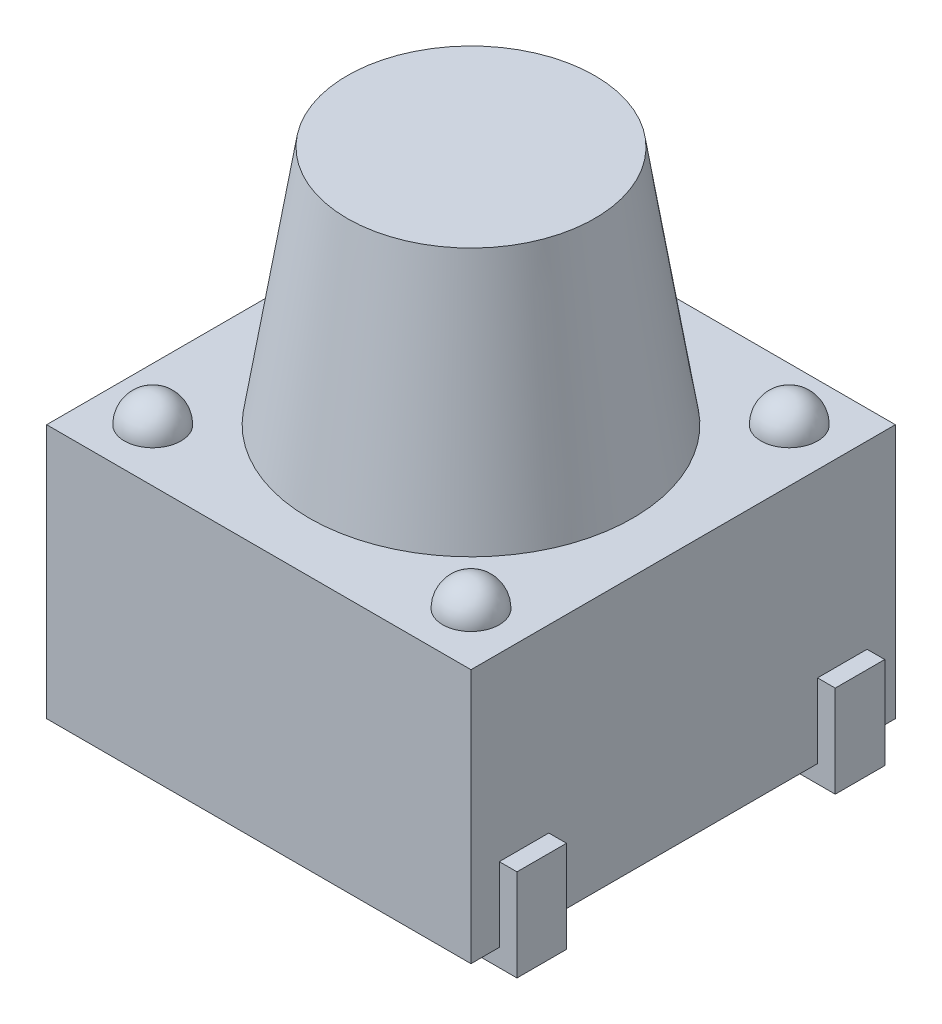
ISO-10303-21;
HEADER;
FILE_DESCRIPTION(('STEP AP214'),'2;1');
FILE_NAME('part.step','',(''),(''),'','','');
FILE_SCHEMA(('AUTOMOTIVE_DESIGN { 1 0 10303 214 1 1 1 1 }'));
ENDSEC;
DATA;
#1=APPLICATION_CONTEXT('core data for automotive mechanical design processes');
#2=APPLICATION_PROTOCOL_DEFINITION('international standard','automotive_design',2000,#1);
#3=PRODUCT_CONTEXT('',#1,'mechanical');
#4=PRODUCT('Part','Part','',(#3));
#5=PRODUCT_RELATED_PRODUCT_CATEGORY('part','',(#4));
#6=PRODUCT_DEFINITION_FORMATION('','',#4);
#7=PRODUCT_DEFINITION_CONTEXT('part definition',#1,'design');
#8=PRODUCT_DEFINITION('design','',#6,#7);
#9=PRODUCT_DEFINITION_SHAPE('','',#8);
#10=(LENGTH_UNIT() NAMED_UNIT(*) SI_UNIT(.MILLI.,.METRE.));
#11=(NAMED_UNIT(*) PLANE_ANGLE_UNIT() SI_UNIT($,.RADIAN.));
#12=(NAMED_UNIT(*) SI_UNIT($,.STERADIAN.) SOLID_ANGLE_UNIT());
#13=UNCERTAINTY_MEASURE_WITH_UNIT(LENGTH_MEASURE(1.E-05),#10,'distance_accuracy_value','');
#14=(GEOMETRIC_REPRESENTATION_CONTEXT(3) GLOBAL_UNCERTAINTY_ASSIGNED_CONTEXT((#13)) GLOBAL_UNIT_ASSIGNED_CONTEXT((#10,
#11,#12)) REPRESENTATION_CONTEXT('',''));
#15=CARTESIAN_POINT('',(0.,0.,0.));
#16=DIRECTION('',(0.,0.,1.));
#17=DIRECTION('',(1.,0.,0.));
#18=AXIS2_PLACEMENT_3D('',#15,#16,#17);
#19=CARTESIAN_POINT('',(-3.,3.6,3.));
#20=DIRECTION('',(0.,1.,0.));
#21=DIRECTION('',(0.,0.,1.));
#22=AXIS2_PLACEMENT_3D('',#19,#20,#21);
#23=PLANE('',#22);
#24=CARTESIAN_POINT('',(0.,3.6,0.));
#25=DIRECTION('',(0.,1.,0.));
#26=DIRECTION('',(0.,0.,1.));
#27=AXIS2_PLACEMENT_3D('',#24,#25,#26);
#28=CIRCLE('',#27,2.28850709710341);
#29=CARTESIAN_POINT('',(0.,3.6,2.28850709710341));
#30=VERTEX_POINT('',#29);
#31=EDGE_CURVE('E11',#30,#30,#28,.T.);
#32=ORIENTED_EDGE('',*,*,#31,.F.);
#33=EDGE_LOOP('',(#32));
#34=FACE_BOUND('',#33,.T.);
#35=CARTESIAN_POINT('',(2.25,3.6,-2.25));
#36=DIRECTION('',(0.,1.,0.));
#37=DIRECTION('',(0.,0.,-1.));
#38=AXIS2_PLACEMENT_3D('',#35,#36,#37);
#39=CIRCLE('',#38,0.4);
#40=CARTESIAN_POINT('',(2.25,3.6,-2.65));
#41=VERTEX_POINT('',#40);
#42=EDGE_CURVE('E409',#41,#41,#39,.T.);
#43=ORIENTED_EDGE('',*,*,#42,.F.);
#44=EDGE_LOOP('',(#43));
#45=FACE_BOUND('',#44,.T.);
#46=CARTESIAN_POINT('',(-2.25,3.6,2.25));
#47=DIRECTION('',(0.,1.,0.));
#48=DIRECTION('',(0.,0.,1.));
#49=AXIS2_PLACEMENT_3D('',#46,#47,#48);
#50=CIRCLE('',#49,0.4);
#51=CARTESIAN_POINT('',(-2.25,3.6,2.65));
#52=VERTEX_POINT('',#51);
#53=EDGE_CURVE('E415',#52,#52,#50,.T.);
#54=ORIENTED_EDGE('',*,*,#53,.F.);
#55=EDGE_LOOP('',(#54));
#56=FACE_BOUND('',#55,.T.);
#57=DIRECTION('',(0.,0.,1.));
#58=VECTOR('',#57,1.);
#59=CARTESIAN_POINT('',(-3.,3.6,-3.));
#60=LINE('',#59,#58);
#61=CARTESIAN_POINT('',(-3.,3.6,-3.));
#62=VERTEX_POINT('',#61);
#63=CARTESIAN_POINT('',(-3.,3.6,3.));
#64=VERTEX_POINT('',#63);
#65=EDGE_CURVE('E419',#62,#64,#60,.T.);
#66=ORIENTED_EDGE('',*,*,#65,.T.);
#67=DIRECTION('',(1.,0.,0.));
#68=VECTOR('',#67,1.);
#69=CARTESIAN_POINT('',(-3.,3.6,3.));
#70=LINE('',#69,#68);
#71=CARTESIAN_POINT('',(3.,3.6,3.));
#72=VERTEX_POINT('',#71);
#73=EDGE_CURVE('E422',#64,#72,#70,.T.);
#74=ORIENTED_EDGE('',*,*,#73,.T.);
#75=DIRECTION('',(0.,0.,-1.));
#76=VECTOR('',#75,1.);
#77=CARTESIAN_POINT('',(3.,3.6,-3.));
#78=LINE('',#77,#76);
#79=CARTESIAN_POINT('',(3.,3.6,-3.));
#80=VERTEX_POINT('',#79);
#81=EDGE_CURVE('E425',#72,#80,#78,.T.);
#82=ORIENTED_EDGE('',*,*,#81,.T.);
#83=DIRECTION('',(-1.,0.,0.));
#84=VECTOR('',#83,1.);
#85=CARTESIAN_POINT('',(-3.,3.6,-3.));
#86=LINE('',#85,#84);
#87=EDGE_CURVE('E427',#80,#62,#86,.T.);
#88=ORIENTED_EDGE('',*,*,#87,.T.);
#89=EDGE_LOOP('',(#66,#74,#82,#88));
#90=FACE_BOUND('',#89,.T.);
#91=CARTESIAN_POINT('',(-2.25,3.6,-2.25));
#92=DIRECTION('',(0.,-1.,0.));
#93=DIRECTION('',(0.,0.,-1.));
#94=AXIS2_PLACEMENT_3D('',#91,#92,#93);
#95=CIRCLE('',#94,0.4);
#96=CARTESIAN_POINT('',(-2.25,3.6,-2.65));
#97=VERTEX_POINT('',#96);
#98=EDGE_CURVE('E412',#97,#97,#95,.T.);
#99=ORIENTED_EDGE('',*,*,#98,.T.);
#100=EDGE_LOOP('',(#99));
#101=FACE_BOUND('',#100,.T.);
#102=CARTESIAN_POINT('',(2.25,3.6,2.25));
#103=DIRECTION('',(0.,-1.,0.));
#104=DIRECTION('',(0.,0.,1.));
#105=AXIS2_PLACEMENT_3D('',#102,#103,#104);
#106=CIRCLE('',#105,0.4);
#107=CARTESIAN_POINT('',(2.25,3.6,2.65));
#108=VERTEX_POINT('',#107);
#109=EDGE_CURVE('E406',#108,#108,#106,.T.);
#110=ORIENTED_EDGE('',*,*,#109,.T.);
#111=EDGE_LOOP('',(#110));
#112=FACE_BOUND('',#111,.T.);
#113=ADVANCED_FACE('F36',(#34,#45,#56,#90,#101,#112),#23,.T.);
#114=CARTESIAN_POINT('',(-3.,3.6,-3.));
#115=DIRECTION('',(1.,0.,0.));
#116=DIRECTION('',(0.,0.,-1.));
#117=AXIS2_PLACEMENT_3D('',#114,#115,#116);
#118=PLANE('',#117);
#119=DIRECTION('',(0.,0.,1.));
#120=VECTOR('',#119,1.);
#121=CARTESIAN_POINT('',(-3.,0.,-3.));
#122=LINE('',#121,#120);
#123=CARTESIAN_POINT('',(-3.,0.,-3.));
#124=VERTEX_POINT('',#123);
#125=CARTESIAN_POINT('',(-3.,0.,-2.6));
#126=VERTEX_POINT('',#125);
#127=EDGE_CURVE('E430',#124,#126,#122,.T.);
#128=ORIENTED_EDGE('',*,*,#127,.T.);
#129=DIRECTION('',(0.,1.,0.));
#130=VECTOR('',#129,1.);
#131=CARTESIAN_POINT('',(-3.,1.05,-2.6));
#132=LINE('',#131,#130);
#133=CARTESIAN_POINT('',(-3.,1.05,-2.6));
#134=VERTEX_POINT('',#133);
#135=EDGE_CURVE('E316',#126,#134,#132,.T.);
#136=ORIENTED_EDGE('',*,*,#135,.T.);
#137=DIRECTION('',(0.,0.,1.));
#138=VECTOR('',#137,1.);
#139=CARTESIAN_POINT('',(-3.,1.05,-2.6));
#140=LINE('',#139,#138);
#141=CARTESIAN_POINT('',(-3.,1.05,-1.9));
#142=VERTEX_POINT('',#141);
#143=EDGE_CURVE('E333',#134,#142,#140,.T.);
#144=ORIENTED_EDGE('',*,*,#143,.T.);
#145=DIRECTION('',(0.,1.,0.));
#146=VECTOR('',#145,1.);
#147=CARTESIAN_POINT('',(-3.,1.05,-1.9));
#148=LINE('',#147,#146);
#149=CARTESIAN_POINT('',(-3.,0.,-1.9));
#150=VERTEX_POINT('',#149);
#151=EDGE_CURVE('E315',#150,#142,#148,.T.);
#152=ORIENTED_EDGE('',*,*,#151,.F.);
#153=CARTESIAN_POINT('',(-3.,0.,1.9));
#154=VERTEX_POINT('',#153);
#155=EDGE_CURVE('E434',#150,#154,#122,.T.);
#156=ORIENTED_EDGE('',*,*,#155,.T.);
#157=DIRECTION('',(0.,1.,0.));
#158=VECTOR('',#157,1.);
#159=CARTESIAN_POINT('',(-3.,1.05,1.9));
#160=LINE('',#159,#158);
#161=CARTESIAN_POINT('',(-3.,1.05,1.9));
#162=VERTEX_POINT('',#161);
#163=EDGE_CURVE('E360',#154,#162,#160,.T.);
#164=ORIENTED_EDGE('',*,*,#163,.T.);
#165=DIRECTION('',(0.,0.,-1.));
#166=VECTOR('',#165,1.);
#167=CARTESIAN_POINT('',(-3.,1.05,2.6));
#168=LINE('',#167,#166);
#169=CARTESIAN_POINT('',(-3.,1.05,2.6));
#170=VERTEX_POINT('',#169);
#171=EDGE_CURVE('E400',#170,#162,#168,.T.);
#172=ORIENTED_EDGE('',*,*,#171,.F.);
#173=DIRECTION('',(0.,1.,0.));
#174=VECTOR('',#173,1.);
#175=CARTESIAN_POINT('',(-3.,1.05,2.6));
#176=LINE('',#175,#174);
#177=CARTESIAN_POINT('',(-3.,0.,2.6));
#178=VERTEX_POINT('',#177);
#179=EDGE_CURVE('E361',#178,#170,#176,.T.);
#180=ORIENTED_EDGE('',*,*,#179,.F.);
#181=CARTESIAN_POINT('',(-3.,0.,3.));
#182=VERTEX_POINT('',#181);
#183=EDGE_CURVE('E418',#178,#182,#122,.T.);
#184=ORIENTED_EDGE('',*,*,#183,.T.);
#185=DIRECTION('',(0.,-1.,0.));
#186=VECTOR('',#185,1.);
#187=CARTESIAN_POINT('',(-3.,3.6,3.));
#188=LINE('',#187,#186);
#189=EDGE_CURVE('E44',#64,#182,#188,.T.);
#190=ORIENTED_EDGE('',*,*,#189,.F.);
#191=ORIENTED_EDGE('',*,*,#65,.F.);
#192=DIRECTION('',(0.,-1.,0.));
#193=VECTOR('',#192,1.);
#194=CARTESIAN_POINT('',(-3.,3.6,-3.));
#195=LINE('',#194,#193);
#196=EDGE_CURVE('E429',#62,#124,#195,.T.);
#197=ORIENTED_EDGE('',*,*,#196,.T.);
#198=EDGE_LOOP('',(#128,#136,#144,#152,#156,#164,#172,#180,#184,#190,#191,#197));
#199=FACE_BOUND('',#198,.T.);
#200=ADVANCED_FACE('F38',(#199),#118,.F.);
#201=CARTESIAN_POINT('',(-3.,3.6,3.));
#202=DIRECTION('',(0.,0.,-1.));
#203=DIRECTION('',(-1.,0.,0.));
#204=AXIS2_PLACEMENT_3D('',#201,#202,#203);
#205=PLANE('',#204);
#206=DIRECTION('',(1.,0.,0.));
#207=VECTOR('',#206,1.);
#208=CARTESIAN_POINT('',(-3.,0.,3.));
#209=LINE('',#208,#207);
#210=CARTESIAN_POINT('',(3.,0.,3.));
#211=VERTEX_POINT('',#210);
#212=EDGE_CURVE('E433',#182,#211,#209,.T.);
#213=ORIENTED_EDGE('',*,*,#212,.T.);
#214=DIRECTION('',(0.,-1.,0.));
#215=VECTOR('',#214,1.);
#216=CARTESIAN_POINT('',(3.,3.6,3.));
#217=LINE('',#216,#215);
#218=EDGE_CURVE('E446',#72,#211,#217,.T.);
#219=ORIENTED_EDGE('',*,*,#218,.F.);
#220=ORIENTED_EDGE('',*,*,#73,.F.);
#221=ORIENTED_EDGE('',*,*,#189,.T.);
#222=EDGE_LOOP('',(#213,#219,#220,#221));
#223=FACE_BOUND('',#222,.T.);
#224=ADVANCED_FACE('F451',(#223),#205,.F.);
#225=CARTESIAN_POINT('',(3.,3.6,-3.));
#226=DIRECTION('',(-1.,0.,0.));
#227=DIRECTION('',(0.,0.,1.));
#228=AXIS2_PLACEMENT_3D('',#225,#226,#227);
#229=PLANE('',#228);
#230=DIRECTION('',(0.,0.,-1.));
#231=VECTOR('',#230,1.);
#232=CARTESIAN_POINT('',(3.,0.,-3.));
#233=LINE('',#232,#231);
#234=CARTESIAN_POINT('',(3.,0.,2.6));
#235=VERTEX_POINT('',#234);
#236=EDGE_CURVE('E437',#211,#235,#233,.T.);
#237=ORIENTED_EDGE('',*,*,#236,.T.);
#238=DIRECTION('',(0.,1.,0.));
#239=VECTOR('',#238,1.);
#240=CARTESIAN_POINT('',(3.,1.05,2.6));
#241=LINE('',#240,#239);
#242=CARTESIAN_POINT('',(3.,1.05,2.6));
#243=VERTEX_POINT('',#242);
#244=EDGE_CURVE('E51',#235,#243,#241,.T.);
#245=ORIENTED_EDGE('',*,*,#244,.T.);
#246=DIRECTION('',(0.,0.,-1.));
#247=VECTOR('',#246,1.);
#248=CARTESIAN_POINT('',(3.,1.05,2.6));
#249=LINE('',#248,#247);
#250=CARTESIAN_POINT('',(3.,1.05,1.9));
#251=VERTEX_POINT('',#250);
#252=EDGE_CURVE('E55',#243,#251,#249,.T.);
#253=ORIENTED_EDGE('',*,*,#252,.T.);
#254=DIRECTION('',(0.,1.,0.));
#255=VECTOR('',#254,1.);
#256=CARTESIAN_POINT('',(3.,1.05,1.9));
#257=LINE('',#256,#255);
#258=CARTESIAN_POINT('',(3.,0.,1.9));
#259=VERTEX_POINT('',#258);
#260=EDGE_CURVE('E253',#259,#251,#257,.T.);
#261=ORIENTED_EDGE('',*,*,#260,.F.);
#262=CARTESIAN_POINT('',(3.,0.,-1.9));
#263=VERTEX_POINT('',#262);
#264=EDGE_CURVE('E439',#259,#263,#233,.T.);
#265=ORIENTED_EDGE('',*,*,#264,.T.);
#266=DIRECTION('',(0.,1.,0.));
#267=VECTOR('',#266,1.);
#268=CARTESIAN_POINT('',(3.,1.05,-1.9));
#269=LINE('',#268,#267);
#270=CARTESIAN_POINT('',(3.,1.05,-1.9));
#271=VERTEX_POINT('',#270);
#272=EDGE_CURVE('E272',#263,#271,#269,.T.);
#273=ORIENTED_EDGE('',*,*,#272,.T.);
#274=DIRECTION('',(0.,0.,1.));
#275=VECTOR('',#274,1.);
#276=CARTESIAN_POINT('',(3.,1.05,-2.6));
#277=LINE('',#276,#275);
#278=CARTESIAN_POINT('',(3.,1.05,-2.6));
#279=VERTEX_POINT('',#278);
#280=EDGE_CURVE('E312',#279,#271,#277,.T.);
#281=ORIENTED_EDGE('',*,*,#280,.F.);
#282=DIRECTION('',(0.,1.,0.));
#283=VECTOR('',#282,1.);
#284=CARTESIAN_POINT('',(3.,1.05,-2.6));
#285=LINE('',#284,#283);
#286=CARTESIAN_POINT('',(3.,0.,-2.6));
#287=VERTEX_POINT('',#286);
#288=EDGE_CURVE('E273',#287,#279,#285,.T.);
#289=ORIENTED_EDGE('',*,*,#288,.F.);
#290=CARTESIAN_POINT('',(3.,0.,-3.));
#291=VERTEX_POINT('',#290);
#292=EDGE_CURVE('E436',#287,#291,#233,.T.);
#293=ORIENTED_EDGE('',*,*,#292,.T.);
#294=DIRECTION('',(0.,-1.,0.));
#295=VECTOR('',#294,1.);
#296=CARTESIAN_POINT('',(3.,3.6,-3.));
#297=LINE('',#296,#295);
#298=EDGE_CURVE('E443',#80,#291,#297,.T.);
#299=ORIENTED_EDGE('',*,*,#298,.F.);
#300=ORIENTED_EDGE('',*,*,#81,.F.);
#301=ORIENTED_EDGE('',*,*,#218,.T.);
#302=EDGE_LOOP('',(#237,#245,#253,#261,#265,#273,#281,#289,#293,#299,#300,#301));
#303=FACE_BOUND('',#302,.T.);
#304=ADVANCED_FACE('F460',(#303),#229,.F.);
#305=CARTESIAN_POINT('',(-3.,3.6,-3.));
#306=DIRECTION('',(0.,0.,1.));
#307=DIRECTION('',(1.,0.,0.));
#308=AXIS2_PLACEMENT_3D('',#305,#306,#307);
#309=PLANE('',#308);
#310=DIRECTION('',(-1.,0.,0.));
#311=VECTOR('',#310,1.);
#312=CARTESIAN_POINT('',(-3.,0.,-3.));
#313=LINE('',#312,#311);
#314=EDGE_CURVE('E423',#291,#124,#313,.T.);
#315=ORIENTED_EDGE('',*,*,#314,.T.);
#316=ORIENTED_EDGE('',*,*,#196,.F.);
#317=ORIENTED_EDGE('',*,*,#87,.F.);
#318=ORIENTED_EDGE('',*,*,#298,.T.);
#319=EDGE_LOOP('',(#315,#316,#317,#318));
#320=FACE_BOUND('',#319,.T.);
#321=ADVANCED_FACE('F523',(#320),#309,.F.);
#322=CARTESIAN_POINT('',(-3.,0.,3.));
#323=DIRECTION('',(0.,1.,0.));
#324=DIRECTION('',(0.,0.,1.));
#325=AXIS2_PLACEMENT_3D('',#322,#323,#324);
#326=PLANE('',#325);
#327=DIRECTION('',(0.,0.,-1.));
#328=VECTOR('',#327,1.);
#329=CARTESIAN_POINT('',(2.21538836533738,0.,2.6));
#330=LINE('',#329,#328);
#331=CARTESIAN_POINT('',(2.21538836533738,0.,2.6));
#332=VERTEX_POINT('',#331);
#333=CARTESIAN_POINT('',(2.21538836533738,0.,1.9));
#334=VERTEX_POINT('',#333);
#335=EDGE_CURVE('E232',#332,#334,#330,.T.);
#336=ORIENTED_EDGE('',*,*,#335,.F.);
#337=DIRECTION('',(1.,0.,0.));
#338=VECTOR('',#337,1.);
#339=CARTESIAN_POINT('',(3.,0.,2.6));
#340=LINE('',#339,#338);
#341=EDGE_CURVE('E242',#332,#235,#340,.T.);
#342=ORIENTED_EDGE('',*,*,#341,.T.);
#343=ORIENTED_EDGE('',*,*,#236,.F.);
#344=ORIENTED_EDGE('',*,*,#212,.F.);
#345=ORIENTED_EDGE('',*,*,#183,.F.);
#346=DIRECTION('',(-1.,0.,0.));
#347=VECTOR('',#346,1.);
#348=CARTESIAN_POINT('',(-3.,0.,2.6));
#349=LINE('',#348,#347);
#350=CARTESIAN_POINT('',(-2.21538836533738,0.,2.6));
#351=VERTEX_POINT('',#350);
#352=EDGE_CURVE('E374',#351,#178,#349,.T.);
#353=ORIENTED_EDGE('',*,*,#352,.F.);
#354=DIRECTION('',(0.,0.,-1.));
#355=VECTOR('',#354,1.);
#356=CARTESIAN_POINT('',(-2.21538836533738,0.,2.6));
#357=LINE('',#356,#355);
#358=CARTESIAN_POINT('',(-2.21538836533738,0.,1.9));
#359=VERTEX_POINT('',#358);
#360=EDGE_CURVE('E377',#351,#359,#357,.T.);
#361=ORIENTED_EDGE('',*,*,#360,.T.);
#362=DIRECTION('',(-1.,0.,0.));
#363=VECTOR('',#362,1.);
#364=CARTESIAN_POINT('',(-3.,0.,1.9));
#365=LINE('',#364,#363);
#366=EDGE_CURVE('E365',#359,#154,#365,.T.);
#367=ORIENTED_EDGE('',*,*,#366,.T.);
#368=ORIENTED_EDGE('',*,*,#155,.F.);
#369=DIRECTION('',(-1.,0.,0.));
#370=VECTOR('',#369,1.);
#371=CARTESIAN_POINT('',(-3.,0.,-1.9));
#372=LINE('',#371,#370);
#373=CARTESIAN_POINT('',(-2.21538836533738,0.,-1.9));
#374=VERTEX_POINT('',#373);
#375=EDGE_CURVE('E336',#374,#150,#372,.T.);
#376=ORIENTED_EDGE('',*,*,#375,.F.);
#377=DIRECTION('',(0.,0.,1.));
#378=VECTOR('',#377,1.);
#379=CARTESIAN_POINT('',(-2.21538836533738,0.,-2.6));
#380=LINE('',#379,#378);
#381=CARTESIAN_POINT('',(-2.21538836533738,0.,-2.6));
#382=VERTEX_POINT('',#381);
#383=EDGE_CURVE('E357',#382,#374,#380,.T.);
#384=ORIENTED_EDGE('',*,*,#383,.F.);
#385=DIRECTION('',(-1.,0.,0.));
#386=VECTOR('',#385,1.);
#387=CARTESIAN_POINT('',(-3.,0.,-2.6));
#388=LINE('',#387,#386);
#389=EDGE_CURVE('E318',#382,#126,#388,.T.);
#390=ORIENTED_EDGE('',*,*,#389,.T.);
#391=ORIENTED_EDGE('',*,*,#127,.F.);
#392=ORIENTED_EDGE('',*,*,#314,.F.);
#393=ORIENTED_EDGE('',*,*,#292,.F.);
#394=DIRECTION('',(1.,0.,0.));
#395=VECTOR('',#394,1.);
#396=CARTESIAN_POINT('',(3.,0.,-2.6));
#397=LINE('',#396,#395);
#398=CARTESIAN_POINT('',(2.21538836533738,0.,-2.6));
#399=VERTEX_POINT('',#398);
#400=EDGE_CURVE('E286',#399,#287,#397,.T.);
#401=ORIENTED_EDGE('',*,*,#400,.F.);
#402=DIRECTION('',(0.,0.,1.));
#403=VECTOR('',#402,1.);
#404=CARTESIAN_POINT('',(2.21538836533738,0.,-2.6));
#405=LINE('',#404,#403);
#406=CARTESIAN_POINT('',(2.21538836533738,0.,-1.9));
#407=VERTEX_POINT('',#406);
#408=EDGE_CURVE('E289',#399,#407,#405,.T.);
#409=ORIENTED_EDGE('',*,*,#408,.T.);
#410=DIRECTION('',(1.,0.,0.));
#411=VECTOR('',#410,1.);
#412=CARTESIAN_POINT('',(3.,0.,-1.9));
#413=LINE('',#412,#411);
#414=EDGE_CURVE('E277',#407,#263,#413,.T.);
#415=ORIENTED_EDGE('',*,*,#414,.T.);
#416=ORIENTED_EDGE('',*,*,#264,.F.);
#417=DIRECTION('',(1.,0.,0.));
#418=VECTOR('',#417,1.);
#419=CARTESIAN_POINT('',(3.,0.,1.9));
#420=LINE('',#419,#418);
#421=EDGE_CURVE('E255',#334,#259,#420,.T.);
#422=ORIENTED_EDGE('',*,*,#421,.F.);
#423=EDGE_LOOP('',(#336,#342,#343,#344,#345,#353,#361,#367,#368,#376,#384,#390,#391,#392,#393,
#401,#409,#415,#416,#422));
#424=FACE_BOUND('',#423,.T.);
#425=ADVANCED_FACE('F459',(#424),#326,.F.);
#426=CARTESIAN_POINT('',(-2.25,3.6,2.25));
#427=DIRECTION('',(0.,1.,0.));
#428=DIRECTION('',(1.,0.,0.));
#429=AXIS2_PLACEMENT_3D('',#426,#427,#428);
#430=SPHERICAL_SURFACE('',#429,0.4);
#431=ORIENTED_EDGE('',*,*,#53,.T.);
#432=EDGE_LOOP('',(#431));
#433=FACE_BOUND('',#432,.T.);
#434=ADVANCED_FACE('F519',(#433),#430,.T.);
#435=CARTESIAN_POINT('',(-2.25,3.6,-2.25));
#436=DIRECTION('',(0.,1.,0.));
#437=DIRECTION('',(1.,0.,0.));
#438=AXIS2_PLACEMENT_3D('',#435,#436,#437);
#439=SPHERICAL_SURFACE('',#438,0.4);
#440=ORIENTED_EDGE('',*,*,#98,.F.);
#441=EDGE_LOOP('',(#440));
#442=FACE_BOUND('',#441,.T.);
#443=ADVANCED_FACE('F551',(#442),#439,.T.);
#444=CARTESIAN_POINT('',(2.25,3.6,-2.25));
#445=DIRECTION('',(0.,1.,0.));
#446=DIRECTION('',(-1.,0.,0.));
#447=AXIS2_PLACEMENT_3D('',#444,#445,#446);
#448=SPHERICAL_SURFACE('',#447,0.4);
#449=ORIENTED_EDGE('',*,*,#42,.T.);
#450=EDGE_LOOP('',(#449));
#451=FACE_BOUND('',#450,.T.);
#452=ADVANCED_FACE('F559',(#451),#448,.T.);
#453=CARTESIAN_POINT('',(2.25,3.6,2.25));
#454=DIRECTION('',(0.,1.,0.));
#455=DIRECTION('',(-1.,0.,0.));
#456=AXIS2_PLACEMENT_3D('',#453,#454,#455);
#457=SPHERICAL_SURFACE('',#456,0.4);
#458=ORIENTED_EDGE('',*,*,#109,.F.);
#459=EDGE_LOOP('',(#458));
#460=FACE_BOUND('',#459,.T.);
#461=ADVANCED_FACE('F566',(#460),#457,.T.);
#462=CARTESIAN_POINT('',(-1.75,7.,0.));
#463=DIRECTION('',(0.,1.,0.));
#464=DIRECTION('',(0.,0.,1.));
#465=AXIS2_PLACEMENT_3D('',#462,#463,#464);
#466=PLANE('',#465);
#467=CARTESIAN_POINT('',(0.,7.,0.));
#468=DIRECTION('',(0.,1.,0.));
#469=DIRECTION('',(0.,0.,1.));
#470=AXIS2_PLACEMENT_3D('',#467,#468,#469);
#471=CIRCLE('',#470,1.75);
#472=CARTESIAN_POINT('',(0.,7.,1.75));
#473=VERTEX_POINT('',#472);
#474=EDGE_CURVE('E403',#473,#473,#471,.T.);
#475=ORIENTED_EDGE('',*,*,#474,.T.);
#476=EDGE_LOOP('',(#475));
#477=FACE_BOUND('',#476,.T.);
#478=ADVANCED_FACE('F574',(#477),#466,.T.);
#479=CARTESIAN_POINT('',(0.,7.,0.));
#480=DIRECTION('',(0.,-1.,0.));
#481=DIRECTION('',(0.,0.,-1.));
#482=AXIS2_PLACEMENT_3D('',#479,#480,#481);
#483=CONICAL_SURFACE('',#482,1.75,0.157079632679487);
#484=ORIENTED_EDGE('',*,*,#31,.T.);
#485=EDGE_LOOP('',(#484));
#486=FACE_BOUND('',#485,.T.);
#487=ORIENTED_EDGE('',*,*,#474,.F.);
#488=EDGE_LOOP('',(#487));
#489=FACE_BOUND('',#488,.T.);
#490=ADVANCED_FACE('F583',(#486,#489),#483,.T.);
#491=CARTESIAN_POINT('',(-3.,1.05,2.6));
#492=DIRECTION('',(0.,-1.,0.));
#493=DIRECTION('',(0.,0.,-1.));
#494=AXIS2_PLACEMENT_3D('',#491,#492,#493);
#495=PLANE('',#494);
#496=DIRECTION('',(-1.,0.,0.));
#497=VECTOR('',#496,1.);
#498=CARTESIAN_POINT('',(-3.,1.05,1.9));
#499=LINE('',#498,#497);
#500=CARTESIAN_POINT('',(-3.25,1.05,1.9));
#501=VERTEX_POINT('',#500);
#502=EDGE_CURVE('E379',#162,#501,#499,.T.);
#503=ORIENTED_EDGE('',*,*,#502,.T.);
#504=DIRECTION('',(0.,0.,-1.));
#505=VECTOR('',#504,1.);
#506=CARTESIAN_POINT('',(-3.25,1.05,2.6));
#507=LINE('',#506,#505);
#508=CARTESIAN_POINT('',(-3.25,1.05,2.6));
#509=VERTEX_POINT('',#508);
#510=EDGE_CURVE('E397',#509,#501,#507,.T.);
#511=ORIENTED_EDGE('',*,*,#510,.F.);
#512=DIRECTION('',(-1.,0.,0.));
#513=VECTOR('',#512,1.);
#514=CARTESIAN_POINT('',(-3.,1.05,2.6));
#515=LINE('',#514,#513);
#516=EDGE_CURVE('E364',#170,#509,#515,.T.);
#517=ORIENTED_EDGE('',*,*,#516,.F.);
#518=ORIENTED_EDGE('',*,*,#171,.T.);
#519=EDGE_LOOP('',(#503,#511,#517,#518));
#520=FACE_BOUND('',#519,.T.);
#521=ADVANCED_FACE('F591',(#520),#495,.F.);
#522=CARTESIAN_POINT('',(-3.25,1.05,2.6));
#523=DIRECTION('',(1.,0.,0.));
#524=DIRECTION('',(0.,0.,-1.));
#525=AXIS2_PLACEMENT_3D('',#522,#523,#524);
#526=PLANE('',#525);
#527=DIRECTION('',(0.,-1.,0.));
#528=VECTOR('',#527,1.);
#529=CARTESIAN_POINT('',(-3.25,1.05,1.9));
#530=LINE('',#529,#528);
#531=CARTESIAN_POINT('',(-3.25,-0.25,1.9));
#532=VERTEX_POINT('',#531);
#533=EDGE_CURVE('E381',#501,#532,#530,.T.);
#534=ORIENTED_EDGE('',*,*,#533,.T.);
#535=DIRECTION('',(0.,0.,-1.));
#536=VECTOR('',#535,1.);
#537=CARTESIAN_POINT('',(-3.25,-0.25,2.6));
#538=LINE('',#537,#536);
#539=CARTESIAN_POINT('',(-3.25,-0.25,2.6));
#540=VERTEX_POINT('',#539);
#541=EDGE_CURVE('E394',#540,#532,#538,.T.);
#542=ORIENTED_EDGE('',*,*,#541,.F.);
#543=DIRECTION('',(0.,-1.,0.));
#544=VECTOR('',#543,1.);
#545=CARTESIAN_POINT('',(-3.25,1.05,2.6));
#546=LINE('',#545,#544);
#547=EDGE_CURVE('E367',#509,#540,#546,.T.);
#548=ORIENTED_EDGE('',*,*,#547,.F.);
#549=ORIENTED_EDGE('',*,*,#510,.T.);
#550=EDGE_LOOP('',(#534,#542,#548,#549));
#551=FACE_BOUND('',#550,.T.);
#552=ADVANCED_FACE('F599',(#551),#526,.F.);
#553=CARTESIAN_POINT('',(-2.21538836533738,-0.25,2.6));
#554=DIRECTION('',(0.,1.,0.));
#555=DIRECTION('',(-1.,0.,0.));
#556=AXIS2_PLACEMENT_3D('',#553,#554,#555);
#557=PLANE('',#556);
#558=DIRECTION('',(1.,0.,0.));
#559=VECTOR('',#558,1.);
#560=CARTESIAN_POINT('',(-2.21538836533738,-0.25,1.9));
#561=LINE('',#560,#559);
#562=CARTESIAN_POINT('',(-2.21538836533738,-0.25,1.9));
#563=VERTEX_POINT('',#562);
#564=EDGE_CURVE('E383',#532,#563,#561,.T.);
#565=ORIENTED_EDGE('',*,*,#564,.T.);
#566=DIRECTION('',(0.,0.,-1.));
#567=VECTOR('',#566,1.);
#568=CARTESIAN_POINT('',(-2.21538836533738,-0.25,2.6));
#569=LINE('',#568,#567);
#570=CARTESIAN_POINT('',(-2.21538836533738,-0.25,2.6));
#571=VERTEX_POINT('',#570);
#572=EDGE_CURVE('E391',#571,#563,#569,.T.);
#573=ORIENTED_EDGE('',*,*,#572,.F.);
#574=DIRECTION('',(1.,0.,0.));
#575=VECTOR('',#574,1.);
#576=CARTESIAN_POINT('',(-2.21538836533738,-0.25,2.6));
#577=LINE('',#576,#575);
#578=EDGE_CURVE('E369',#540,#571,#577,.T.);
#579=ORIENTED_EDGE('',*,*,#578,.F.);
#580=ORIENTED_EDGE('',*,*,#541,.T.);
#581=EDGE_LOOP('',(#565,#573,#579,#580));
#582=FACE_BOUND('',#581,.T.);
#583=ADVANCED_FACE('F607',(#582),#557,.F.);
#584=CARTESIAN_POINT('',(-2.21538836533738,0.,2.6));
#585=DIRECTION('',(-1.,0.,0.));
#586=DIRECTION('',(0.,0.,1.));
#587=AXIS2_PLACEMENT_3D('',#584,#585,#586);
#588=PLANE('',#587);
#589=DIRECTION('',(0.,1.,0.));
#590=VECTOR('',#589,1.);
#591=CARTESIAN_POINT('',(-2.21538836533738,0.,1.9));
#592=LINE('',#591,#590);
#593=EDGE_CURVE('E385',#563,#359,#592,.T.);
#594=ORIENTED_EDGE('',*,*,#593,.T.);
#595=ORIENTED_EDGE('',*,*,#360,.F.);
#596=DIRECTION('',(0.,1.,0.));
#597=VECTOR('',#596,1.);
#598=CARTESIAN_POINT('',(-2.21538836533738,0.,2.6));
#599=LINE('',#598,#597);
#600=EDGE_CURVE('E371',#571,#351,#599,.T.);
#601=ORIENTED_EDGE('',*,*,#600,.F.);
#602=ORIENTED_EDGE('',*,*,#572,.T.);
#603=EDGE_LOOP('',(#594,#595,#601,#602));
#604=FACE_BOUND('',#603,.T.);
#605=ADVANCED_FACE('F615',(#604),#588,.F.);
#606=CARTESIAN_POINT('',(-3.,0.,2.6));
#607=DIRECTION('',(0.,0.,1.));
#608=DIRECTION('',(1.,0.,0.));
#609=AXIS2_PLACEMENT_3D('',#606,#607,#608);
#610=PLANE('',#609);
#611=ORIENTED_EDGE('',*,*,#179,.T.);
#612=ORIENTED_EDGE('',*,*,#516,.T.);
#613=ORIENTED_EDGE('',*,*,#547,.T.);
#614=ORIENTED_EDGE('',*,*,#578,.T.);
#615=ORIENTED_EDGE('',*,*,#600,.T.);
#616=ORIENTED_EDGE('',*,*,#352,.T.);
#617=EDGE_LOOP('',(#611,#612,#613,#614,#615,#616));
#618=FACE_BOUND('',#617,.T.);
#619=ADVANCED_FACE('F623',(#618),#610,.T.);
#620=CARTESIAN_POINT('',(-3.,0.,1.9));
#621=DIRECTION('',(0.,0.,1.));
#622=DIRECTION('',(1.,0.,0.));
#623=AXIS2_PLACEMENT_3D('',#620,#621,#622);
#624=PLANE('',#623);
#625=ORIENTED_EDGE('',*,*,#163,.F.);
#626=ORIENTED_EDGE('',*,*,#366,.F.);
#627=ORIENTED_EDGE('',*,*,#593,.F.);
#628=ORIENTED_EDGE('',*,*,#564,.F.);
#629=ORIENTED_EDGE('',*,*,#533,.F.);
#630=ORIENTED_EDGE('',*,*,#502,.F.);
#631=EDGE_LOOP('',(#625,#626,#627,#628,#629,#630));
#632=FACE_BOUND('',#631,.T.);
#633=ADVANCED_FACE('F631',(#632),#624,.F.);
#634=CARTESIAN_POINT('',(-2.21538836533738,0.,-2.6));
#635=DIRECTION('',(1.,0.,0.));
#636=DIRECTION('',(0.,0.,-1.));
#637=AXIS2_PLACEMENT_3D('',#634,#635,#636);
#638=PLANE('',#637);
#639=DIRECTION('',(0.,1.,0.));
#640=VECTOR('',#639,1.);
#641=CARTESIAN_POINT('',(-2.21538836533738,0.,-1.9));
#642=LINE('',#641,#640);
#643=CARTESIAN_POINT('',(-2.21538836533738,-0.25,-1.9));
#644=VERTEX_POINT('',#643);
#645=EDGE_CURVE('E339',#644,#374,#642,.T.);
#646=ORIENTED_EDGE('',*,*,#645,.F.);
#647=DIRECTION('',(0.,0.,1.));
#648=VECTOR('',#647,1.);
#649=CARTESIAN_POINT('',(-2.21538836533738,-0.25,-2.6));
#650=LINE('',#649,#648);
#651=CARTESIAN_POINT('',(-2.21538836533738,-0.25,-2.6));
#652=VERTEX_POINT('',#651);
#653=EDGE_CURVE('E355',#652,#644,#650,.T.);
#654=ORIENTED_EDGE('',*,*,#653,.F.);
#655=DIRECTION('',(0.,1.,0.));
#656=VECTOR('',#655,1.);
#657=CARTESIAN_POINT('',(-2.21538836533738,0.,-2.6));
#658=LINE('',#657,#656);
#659=EDGE_CURVE('E321',#652,#382,#658,.T.);
#660=ORIENTED_EDGE('',*,*,#659,.T.);
#661=ORIENTED_EDGE('',*,*,#383,.T.);
#662=EDGE_LOOP('',(#646,#654,#660,#661));
#663=FACE_BOUND('',#662,.T.);
#664=ADVANCED_FACE('F639',(#663),#638,.T.);
#665=CARTESIAN_POINT('',(-2.21538836533738,-0.25,-2.6));
#666=DIRECTION('',(0.,-1.,0.));
#667=DIRECTION('',(1.,0.,0.));
#668=AXIS2_PLACEMENT_3D('',#665,#666,#667);
#669=PLANE('',#668);
#670=DIRECTION('',(1.,0.,0.));
#671=VECTOR('',#670,1.);
#672=CARTESIAN_POINT('',(-2.21538836533738,-0.25,-1.9));
#673=LINE('',#672,#671);
#674=CARTESIAN_POINT('',(-3.25,-0.25,-1.9));
#675=VERTEX_POINT('',#674);
#676=EDGE_CURVE('E342',#675,#644,#673,.T.);
#677=ORIENTED_EDGE('',*,*,#676,.F.);
#678=DIRECTION('',(0.,0.,1.));
#679=VECTOR('',#678,1.);
#680=CARTESIAN_POINT('',(-3.25,-0.25,-2.6));
#681=LINE('',#680,#679);
#682=CARTESIAN_POINT('',(-3.25,-0.25,-2.6));
#683=VERTEX_POINT('',#682);
#684=EDGE_CURVE('E353',#683,#675,#681,.T.);
#685=ORIENTED_EDGE('',*,*,#684,.F.);
#686=DIRECTION('',(1.,0.,0.));
#687=VECTOR('',#686,1.);
#688=CARTESIAN_POINT('',(-2.21538836533738,-0.25,-2.6));
#689=LINE('',#688,#687);
#690=EDGE_CURVE('E324',#683,#652,#689,.T.);
#691=ORIENTED_EDGE('',*,*,#690,.T.);
#692=ORIENTED_EDGE('',*,*,#653,.T.);
#693=EDGE_LOOP('',(#677,#685,#691,#692));
#694=FACE_BOUND('',#693,.T.);
#695=ADVANCED_FACE('F648',(#694),#669,.T.);
#696=CARTESIAN_POINT('',(-3.25,1.05,-2.6));
#697=DIRECTION('',(-1.,0.,0.));
#698=DIRECTION('',(0.,0.,1.));
#699=AXIS2_PLACEMENT_3D('',#696,#697,#698);
#700=PLANE('',#699);
#701=DIRECTION('',(0.,-1.,0.));
#702=VECTOR('',#701,1.);
#703=CARTESIAN_POINT('',(-3.25,1.05,-1.9));
#704=LINE('',#703,#702);
#705=CARTESIAN_POINT('',(-3.25,1.05,-1.9));
#706=VERTEX_POINT('',#705);
#707=EDGE_CURVE('E345',#706,#675,#704,.T.);
#708=ORIENTED_EDGE('',*,*,#707,.F.);
#709=DIRECTION('',(0.,0.,1.));
#710=VECTOR('',#709,1.);
#711=CARTESIAN_POINT('',(-3.25,1.05,-2.6));
#712=LINE('',#711,#710);
#713=CARTESIAN_POINT('',(-3.25,1.05,-2.6));
#714=VERTEX_POINT('',#713);
#715=EDGE_CURVE('E351',#714,#706,#712,.T.);
#716=ORIENTED_EDGE('',*,*,#715,.F.);
#717=DIRECTION('',(0.,-1.,0.));
#718=VECTOR('',#717,1.);
#719=CARTESIAN_POINT('',(-3.25,1.05,-2.6));
#720=LINE('',#719,#718);
#721=EDGE_CURVE('E327',#714,#683,#720,.T.);
#722=ORIENTED_EDGE('',*,*,#721,.T.);
#723=ORIENTED_EDGE('',*,*,#684,.T.);
#724=EDGE_LOOP('',(#708,#716,#722,#723));
#725=FACE_BOUND('',#724,.T.);
#726=ADVANCED_FACE('F656',(#725),#700,.T.);
#727=CARTESIAN_POINT('',(-3.,1.05,-2.6));
#728=DIRECTION('',(0.,1.,0.));
#729=DIRECTION('',(0.,0.,1.));
#730=AXIS2_PLACEMENT_3D('',#727,#728,#729);
#731=PLANE('',#730);
#732=DIRECTION('',(-1.,0.,0.));
#733=VECTOR('',#732,1.);
#734=CARTESIAN_POINT('',(-3.,1.05,-1.9));
#735=LINE('',#734,#733);
#736=EDGE_CURVE('E319',#142,#706,#735,.T.);
#737=ORIENTED_EDGE('',*,*,#736,.F.);
#738=ORIENTED_EDGE('',*,*,#143,.F.);
#739=DIRECTION('',(-1.,0.,0.));
#740=VECTOR('',#739,1.);
#741=CARTESIAN_POINT('',(-3.,1.05,-2.6));
#742=LINE('',#741,#740);
#743=EDGE_CURVE('E330',#134,#714,#742,.T.);
#744=ORIENTED_EDGE('',*,*,#743,.T.);
#745=ORIENTED_EDGE('',*,*,#715,.T.);
#746=EDGE_LOOP('',(#737,#738,#744,#745));
#747=FACE_BOUND('',#746,.T.);
#748=ADVANCED_FACE('F664',(#747),#731,.T.);
#749=CARTESIAN_POINT('',(-3.,0.,-2.6));
#750=DIRECTION('',(0.,0.,-1.));
#751=DIRECTION('',(1.,0.,0.));
#752=AXIS2_PLACEMENT_3D('',#749,#750,#751);
#753=PLANE('',#752);
#754=ORIENTED_EDGE('',*,*,#135,.F.);
#755=ORIENTED_EDGE('',*,*,#389,.F.);
#756=ORIENTED_EDGE('',*,*,#659,.F.);
#757=ORIENTED_EDGE('',*,*,#690,.F.);
#758=ORIENTED_EDGE('',*,*,#721,.F.);
#759=ORIENTED_EDGE('',*,*,#743,.F.);
#760=EDGE_LOOP('',(#754,#755,#756,#757,#758,#759));
#761=FACE_BOUND('',#760,.T.);
#762=ADVANCED_FACE('F672',(#761),#753,.T.);
#763=CARTESIAN_POINT('',(-3.,0.,-1.9));
#764=DIRECTION('',(0.,0.,-1.));
#765=DIRECTION('',(1.,0.,0.));
#766=AXIS2_PLACEMENT_3D('',#763,#764,#765);
#767=PLANE('',#766);
#768=ORIENTED_EDGE('',*,*,#151,.T.);
#769=ORIENTED_EDGE('',*,*,#736,.T.);
#770=ORIENTED_EDGE('',*,*,#707,.T.);
#771=ORIENTED_EDGE('',*,*,#676,.T.);
#772=ORIENTED_EDGE('',*,*,#645,.T.);
#773=ORIENTED_EDGE('',*,*,#375,.T.);
#774=EDGE_LOOP('',(#768,#769,#770,#771,#772,#773));
#775=FACE_BOUND('',#774,.T.);
#776=ADVANCED_FACE('F507',(#775),#767,.F.);
#777=CARTESIAN_POINT('',(3.,1.05,-2.6));
#778=DIRECTION('',(0.,-1.,0.));
#779=DIRECTION('',(0.,0.,-1.));
#780=AXIS2_PLACEMENT_3D('',#777,#778,#779);
#781=PLANE('',#780);
#782=DIRECTION('',(1.,0.,0.));
#783=VECTOR('',#782,1.);
#784=CARTESIAN_POINT('',(3.,1.05,-1.9));
#785=LINE('',#784,#783);
#786=CARTESIAN_POINT('',(3.25,1.05,-1.9));
#787=VERTEX_POINT('',#786);
#788=EDGE_CURVE('E291',#271,#787,#785,.T.);
#789=ORIENTED_EDGE('',*,*,#788,.T.);
#790=DIRECTION('',(0.,0.,1.));
#791=VECTOR('',#790,1.);
#792=CARTESIAN_POINT('',(3.25,1.05,-2.6));
#793=LINE('',#792,#791);
#794=CARTESIAN_POINT('',(3.25,1.05,-2.6));
#795=VERTEX_POINT('',#794);
#796=EDGE_CURVE('E309',#795,#787,#793,.T.);
#797=ORIENTED_EDGE('',*,*,#796,.F.);
#798=DIRECTION('',(1.,0.,0.));
#799=VECTOR('',#798,1.);
#800=CARTESIAN_POINT('',(3.,1.05,-2.6));
#801=LINE('',#800,#799);
#802=EDGE_CURVE('E276',#279,#795,#801,.T.);
#803=ORIENTED_EDGE('',*,*,#802,.F.);
#804=ORIENTED_EDGE('',*,*,#280,.T.);
#805=EDGE_LOOP('',(#789,#797,#803,#804));
#806=FACE_BOUND('',#805,.T.);
#807=ADVANCED_FACE('F482',(#806),#781,.F.);
#808=CARTESIAN_POINT('',(3.25,1.05,-2.6));
#809=DIRECTION('',(-1.,0.,0.));
#810=DIRECTION('',(0.,0.,1.));
#811=AXIS2_PLACEMENT_3D('',#808,#809,#810);
#812=PLANE('',#811);
#813=DIRECTION('',(0.,-1.,0.));
#814=VECTOR('',#813,1.);
#815=CARTESIAN_POINT('',(3.25,1.05,-1.9));
#816=LINE('',#815,#814);
#817=CARTESIAN_POINT('',(3.25,-0.25,-1.9));
#818=VERTEX_POINT('',#817);
#819=EDGE_CURVE('E293',#787,#818,#816,.T.);
#820=ORIENTED_EDGE('',*,*,#819,.T.);
#821=DIRECTION('',(0.,0.,1.));
#822=VECTOR('',#821,1.);
#823=CARTESIAN_POINT('',(3.25,-0.25,-2.6));
#824=LINE('',#823,#822);
#825=CARTESIAN_POINT('',(3.25,-0.25,-2.6));
#826=VERTEX_POINT('',#825);
#827=EDGE_CURVE('E306',#826,#818,#824,.T.);
#828=ORIENTED_EDGE('',*,*,#827,.F.);
#829=DIRECTION('',(0.,-1.,0.));
#830=VECTOR('',#829,1.);
#831=CARTESIAN_POINT('',(3.25,1.05,-2.6));
#832=LINE('',#831,#830);
#833=EDGE_CURVE('E279',#795,#826,#832,.T.);
#834=ORIENTED_EDGE('',*,*,#833,.F.);
#835=ORIENTED_EDGE('',*,*,#796,.T.);
#836=EDGE_LOOP('',(#820,#828,#834,#835));
#837=FACE_BOUND('',#836,.T.);
#838=ADVANCED_FACE('F499',(#837),#812,.F.);
#839=CARTESIAN_POINT('',(2.21538836533738,-0.25,-2.6));
#840=DIRECTION('',(0.,1.,0.));
#841=DIRECTION('',(-1.,0.,0.));
#842=AXIS2_PLACEMENT_3D('',#839,#840,#841);
#843=PLANE('',#842);
#844=DIRECTION('',(-1.,0.,0.));
#845=VECTOR('',#844,1.);
#846=CARTESIAN_POINT('',(2.21538836533738,-0.25,-1.9));
#847=LINE('',#846,#845);
#848=CARTESIAN_POINT('',(2.21538836533738,-0.25,-1.9));
#849=VERTEX_POINT('',#848);
#850=EDGE_CURVE('E295',#818,#849,#847,.T.);
#851=ORIENTED_EDGE('',*,*,#850,.T.);
#852=DIRECTION('',(0.,0.,1.));
#853=VECTOR('',#852,1.);
#854=CARTESIAN_POINT('',(2.21538836533738,-0.25,-2.6));
#855=LINE('',#854,#853);
#856=CARTESIAN_POINT('',(2.21538836533738,-0.25,-2.6));
#857=VERTEX_POINT('',#856);
#858=EDGE_CURVE('E303',#857,#849,#855,.T.);
#859=ORIENTED_EDGE('',*,*,#858,.F.);
#860=DIRECTION('',(-1.,0.,0.));
#861=VECTOR('',#860,1.);
#862=CARTESIAN_POINT('',(2.21538836533738,-0.25,-2.6));
#863=LINE('',#862,#861);
#864=EDGE_CURVE('E281',#826,#857,#863,.T.);
#865=ORIENTED_EDGE('',*,*,#864,.F.);
#866=ORIENTED_EDGE('',*,*,#827,.T.);
#867=EDGE_LOOP('',(#851,#859,#865,#866));
#868=FACE_BOUND('',#867,.T.);
#869=ADVANCED_FACE('F495',(#868),#843,.F.);
#870=CARTESIAN_POINT('',(2.21538836533738,0.,-2.6));
#871=DIRECTION('',(1.,0.,0.));
#872=DIRECTION('',(0.,0.,-1.));
#873=AXIS2_PLACEMENT_3D('',#870,#871,#872);
#874=PLANE('',#873);
#875=DIRECTION('',(0.,1.,0.));
#876=VECTOR('',#875,1.);
#877=CARTESIAN_POINT('',(2.21538836533738,0.,-1.9));
#878=LINE('',#877,#876);
#879=EDGE_CURVE('E297',#849,#407,#878,.T.);
#880=ORIENTED_EDGE('',*,*,#879,.T.);
#881=ORIENTED_EDGE('',*,*,#408,.F.);
#882=DIRECTION('',(0.,1.,0.));
#883=VECTOR('',#882,1.);
#884=CARTESIAN_POINT('',(2.21538836533738,0.,-2.6));
#885=LINE('',#884,#883);
#886=EDGE_CURVE('E283',#857,#399,#885,.T.);
#887=ORIENTED_EDGE('',*,*,#886,.F.);
#888=ORIENTED_EDGE('',*,*,#858,.T.);
#889=EDGE_LOOP('',(#880,#881,#887,#888));
#890=FACE_BOUND('',#889,.T.);
#891=ADVANCED_FACE('F493',(#890),#874,.F.);
#892=CARTESIAN_POINT('',(3.,0.,-2.6));
#893=DIRECTION('',(0.,0.,-1.));
#894=DIRECTION('',(-1.,0.,0.));
#895=AXIS2_PLACEMENT_3D('',#892,#893,#894);
#896=PLANE('',#895);
#897=ORIENTED_EDGE('',*,*,#288,.T.);
#898=ORIENTED_EDGE('',*,*,#802,.T.);
#899=ORIENTED_EDGE('',*,*,#833,.T.);
#900=ORIENTED_EDGE('',*,*,#864,.T.);
#901=ORIENTED_EDGE('',*,*,#886,.T.);
#902=ORIENTED_EDGE('',*,*,#400,.T.);
#903=EDGE_LOOP('',(#897,#898,#899,#900,#901,#902));
#904=FACE_BOUND('',#903,.T.);
#905=ADVANCED_FACE('F488',(#904),#896,.T.);
#906=CARTESIAN_POINT('',(3.,0.,-1.9));
#907=DIRECTION('',(0.,0.,-1.));
#908=DIRECTION('',(-1.,0.,0.));
#909=AXIS2_PLACEMENT_3D('',#906,#907,#908);
#910=PLANE('',#909);
#911=ORIENTED_EDGE('',*,*,#272,.F.);
#912=ORIENTED_EDGE('',*,*,#414,.F.);
#913=ORIENTED_EDGE('',*,*,#879,.F.);
#914=ORIENTED_EDGE('',*,*,#850,.F.);
#915=ORIENTED_EDGE('',*,*,#819,.F.);
#916=ORIENTED_EDGE('',*,*,#788,.F.);
#917=EDGE_LOOP('',(#911,#912,#913,#914,#915,#916));
#918=FACE_BOUND('',#917,.T.);
#919=ADVANCED_FACE('F476',(#918),#910,.F.);
#920=CARTESIAN_POINT('',(2.21538836533738,0.,2.6));
#921=DIRECTION('',(-1.,0.,0.));
#922=DIRECTION('',(0.,0.,1.));
#923=AXIS2_PLACEMENT_3D('',#920,#921,#922);
#924=PLANE('',#923);
#925=DIRECTION('',(0.,1.,0.));
#926=VECTOR('',#925,1.);
#927=CARTESIAN_POINT('',(2.21538836533738,0.,1.9));
#928=LINE('',#927,#926);
#929=CARTESIAN_POINT('',(2.21538836533738,-0.25,1.9));
#930=VERTEX_POINT('',#929);
#931=EDGE_CURVE('E227',#930,#334,#928,.T.);
#932=ORIENTED_EDGE('',*,*,#931,.F.);
#933=DIRECTION('',(0.,0.,-1.));
#934=VECTOR('',#933,1.);
#935=CARTESIAN_POINT('',(2.21538836533738,-0.25,2.6));
#936=LINE('',#935,#934);
#937=CARTESIAN_POINT('',(2.21538836533738,-0.25,2.6));
#938=VERTEX_POINT('',#937);
#939=EDGE_CURVE('E221',#938,#930,#936,.T.);
#940=ORIENTED_EDGE('',*,*,#939,.F.);
#941=DIRECTION('',(0.,1.,0.));
#942=VECTOR('',#941,1.);
#943=CARTESIAN_POINT('',(2.21538836533738,0.,2.6));
#944=LINE('',#943,#942);
#945=EDGE_CURVE('E225',#938,#332,#944,.T.);
#946=ORIENTED_EDGE('',*,*,#945,.T.);
#947=ORIENTED_EDGE('',*,*,#335,.T.);
#948=EDGE_LOOP('',(#932,#940,#946,#947));
#949=FACE_BOUND('',#948,.T.);
#950=ADVANCED_FACE('F223',(#949),#924,.T.);
#951=CARTESIAN_POINT('',(2.21538836533738,-0.25,2.6));
#952=DIRECTION('',(0.,-1.,0.));
#953=DIRECTION('',(1.,0.,0.));
#954=AXIS2_PLACEMENT_3D('',#951,#952,#953);
#955=PLANE('',#954);
#956=DIRECTION('',(-1.,0.,0.));
#957=VECTOR('',#956,1.);
#958=CARTESIAN_POINT('',(2.21538836533738,-0.25,1.9));
#959=LINE('',#958,#957);
#960=CARTESIAN_POINT('',(3.25,-0.25,1.9));
#961=VERTEX_POINT('',#960);
#962=EDGE_CURVE('E259',#961,#930,#959,.T.);
#963=ORIENTED_EDGE('',*,*,#962,.F.);
#964=DIRECTION('',(0.,0.,-1.));
#965=VECTOR('',#964,1.);
#966=CARTESIAN_POINT('',(3.25,-0.25,2.6));
#967=LINE('',#966,#965);
#968=CARTESIAN_POINT('',(3.25,-0.25,2.6));
#969=VERTEX_POINT('',#968);
#970=EDGE_CURVE('E233',#969,#961,#967,.T.);
#971=ORIENTED_EDGE('',*,*,#970,.F.);
#972=DIRECTION('',(-1.,0.,0.));
#973=VECTOR('',#972,1.);
#974=CARTESIAN_POINT('',(2.21538836533738,-0.25,2.6));
#975=LINE('',#974,#973);
#976=EDGE_CURVE('E240',#969,#938,#975,.T.);
#977=ORIENTED_EDGE('',*,*,#976,.T.);
#978=ORIENTED_EDGE('',*,*,#939,.T.);
#979=EDGE_LOOP('',(#963,#971,#977,#978));
#980=FACE_BOUND('',#979,.T.);
#981=ADVANCED_FACE('F244',(#980),#955,.T.);
#982=CARTESIAN_POINT('',(3.25,1.05,2.6));
#983=DIRECTION('',(1.,0.,0.));
#984=DIRECTION('',(0.,0.,-1.));
#985=AXIS2_PLACEMENT_3D('',#982,#983,#984);
#986=PLANE('',#985);
#987=DIRECTION('',(0.,-1.,0.));
#988=VECTOR('',#987,1.);
#989=CARTESIAN_POINT('',(3.25,1.05,1.9));
#990=LINE('',#989,#988);
#991=CARTESIAN_POINT('',(3.25,1.05,1.9));
#992=VERTEX_POINT('',#991);
#993=EDGE_CURVE('E261',#992,#961,#990,.T.);
#994=ORIENTED_EDGE('',*,*,#993,.F.);
#995=DIRECTION('',(0.,0.,-1.));
#996=VECTOR('',#995,1.);
#997=CARTESIAN_POINT('',(3.25,1.05,2.6));
#998=LINE('',#997,#996);
#999=CARTESIAN_POINT('',(3.25,1.05,2.6));
#1000=VERTEX_POINT('',#999);
#1001=EDGE_CURVE('E268',#1000,#992,#998,.T.);
#1002=ORIENTED_EDGE('',*,*,#1001,.F.);
#1003=DIRECTION('',(0.,-1.,0.));
#1004=VECTOR('',#1003,1.);
#1005=CARTESIAN_POINT('',(3.25,1.05,2.6));
#1006=LINE('',#1005,#1004);
#1007=EDGE_CURVE('E245',#1000,#969,#1006,.T.);
#1008=ORIENTED_EDGE('',*,*,#1007,.T.);
#1009=ORIENTED_EDGE('',*,*,#970,.T.);
#1010=EDGE_LOOP('',(#994,#1002,#1008,#1009));
#1011=FACE_BOUND('',#1010,.T.);
#1012=ADVANCED_FACE('F742',(#1011),#986,.T.);
#1013=CARTESIAN_POINT('',(3.,1.05,2.6));
#1014=DIRECTION('',(0.,1.,0.));
#1015=DIRECTION('',(0.,0.,1.));
#1016=AXIS2_PLACEMENT_3D('',#1013,#1014,#1015);
#1017=PLANE('',#1016);
#1018=DIRECTION('',(1.,0.,0.));
#1019=VECTOR('',#1018,1.);
#1020=CARTESIAN_POINT('',(3.,1.05,1.9));
#1021=LINE('',#1020,#1019);
#1022=EDGE_CURVE('E264',#251,#992,#1021,.T.);
#1023=ORIENTED_EDGE('',*,*,#1022,.F.);
#1024=ORIENTED_EDGE('',*,*,#252,.F.);
#1025=DIRECTION('',(1.,0.,0.));
#1026=VECTOR('',#1025,1.);
#1027=CARTESIAN_POINT('',(3.,1.05,2.6));
#1028=LINE('',#1027,#1026);
#1029=EDGE_CURVE('E247',#243,#1000,#1028,.T.);
#1030=ORIENTED_EDGE('',*,*,#1029,.T.);
#1031=ORIENTED_EDGE('',*,*,#1001,.T.);
#1032=EDGE_LOOP('',(#1023,#1024,#1030,#1031));
#1033=FACE_BOUND('',#1032,.T.);
#1034=ADVANCED_FACE('F466',(#1033),#1017,.T.);
#1035=CARTESIAN_POINT('',(3.,0.,2.6));
#1036=DIRECTION('',(0.,0.,1.));
#1037=DIRECTION('',(-1.,0.,0.));
#1038=AXIS2_PLACEMENT_3D('',#1035,#1036,#1037);
#1039=PLANE('',#1038);
#1040=ORIENTED_EDGE('',*,*,#244,.F.);
#1041=ORIENTED_EDGE('',*,*,#341,.F.);
#1042=ORIENTED_EDGE('',*,*,#945,.F.);
#1043=ORIENTED_EDGE('',*,*,#976,.F.);
#1044=ORIENTED_EDGE('',*,*,#1007,.F.);
#1045=ORIENTED_EDGE('',*,*,#1029,.F.);
#1046=EDGE_LOOP('',(#1040,#1041,#1042,#1043,#1044,#1045));
#1047=FACE_BOUND('',#1046,.T.);
#1048=ADVANCED_FACE('F238',(#1047),#1039,.T.);
#1049=CARTESIAN_POINT('',(3.,0.,1.9));
#1050=DIRECTION('',(0.,0.,1.));
#1051=DIRECTION('',(-1.,0.,0.));
#1052=AXIS2_PLACEMENT_3D('',#1049,#1050,#1051);
#1053=PLANE('',#1052);
#1054=ORIENTED_EDGE('',*,*,#260,.T.);
#1055=ORIENTED_EDGE('',*,*,#1022,.T.);
#1056=ORIENTED_EDGE('',*,*,#993,.T.);
#1057=ORIENTED_EDGE('',*,*,#962,.T.);
#1058=ORIENTED_EDGE('',*,*,#931,.T.);
#1059=ORIENTED_EDGE('',*,*,#421,.T.);
#1060=EDGE_LOOP('',(#1054,#1055,#1056,#1057,#1058,#1059));
#1061=FACE_BOUND('',#1060,.T.);
#1062=ADVANCED_FACE('F469',(#1061),#1053,.F.);
#1063=CLOSED_SHELL('',(#113,#200,#224,#304,#321,#425,#434,#443,#452,#461,#478,#490,#521,#552,
#583,#605,#619,#633,#664,#695,#726,#748,#762,#776,#807,#838,#869,#891,#905,#919,#950,#981,#1012,
#1034,#1048,#1062));
#1064=MANIFOLD_SOLID_BREP('B2',#1063);
#1065=ADVANCED_BREP_SHAPE_REPRESENTATION('',(#18,#1064),#14);
#1066=SHAPE_DEFINITION_REPRESENTATION(#9,#1065);
ENDSEC;
END-ISO-10303-21;
